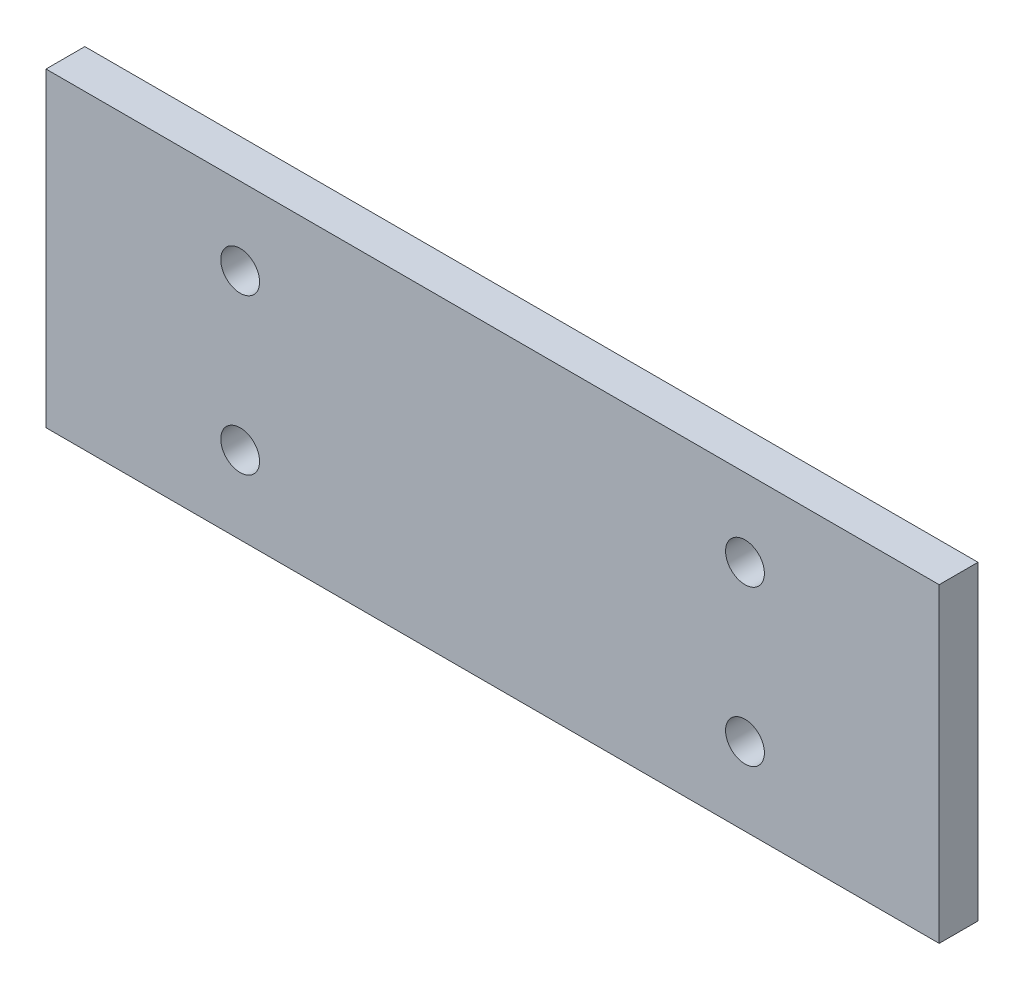
ISO-10303-21;
HEADER;
FILE_DESCRIPTION(('STEP AP214'),'2;1');
FILE_NAME('part.step','',(''),(''),'','','');
FILE_SCHEMA(('AUTOMOTIVE_DESIGN { 1 0 10303 214 1 1 1 1 }'));
ENDSEC;
DATA;
#1=APPLICATION_CONTEXT('core data for automotive mechanical design processes');
#2=APPLICATION_PROTOCOL_DEFINITION('international standard','automotive_design',2000,#1);
#3=PRODUCT_CONTEXT('',#1,'mechanical');
#4=PRODUCT('Part','Part','',(#3));
#5=PRODUCT_RELATED_PRODUCT_CATEGORY('part','',(#4));
#6=PRODUCT_DEFINITION_FORMATION('','',#4);
#7=PRODUCT_DEFINITION_CONTEXT('part definition',#1,'design');
#8=PRODUCT_DEFINITION('design','',#6,#7);
#9=PRODUCT_DEFINITION_SHAPE('','',#8);
#10=(LENGTH_UNIT() NAMED_UNIT(*) SI_UNIT(.MILLI.,.METRE.));
#11=(NAMED_UNIT(*) PLANE_ANGLE_UNIT() SI_UNIT($,.RADIAN.));
#12=(NAMED_UNIT(*) SI_UNIT($,.STERADIAN.) SOLID_ANGLE_UNIT());
#13=UNCERTAINTY_MEASURE_WITH_UNIT(LENGTH_MEASURE(1.E-05),#10,'distance_accuracy_value','');
#14=(GEOMETRIC_REPRESENTATION_CONTEXT(3) GLOBAL_UNCERTAINTY_ASSIGNED_CONTEXT((#13)) GLOBAL_UNIT_ASSIGNED_CONTEXT((#10,
#11,#12)) REPRESENTATION_CONTEXT('',''));
#15=CARTESIAN_POINT('',(0.,0.,0.));
#16=DIRECTION('',(0.,0.,1.));
#17=DIRECTION('',(1.,0.,0.));
#18=AXIS2_PLACEMENT_3D('',#15,#16,#17);
#19=CARTESIAN_POINT('',(0.,0.,5.));
#20=DIRECTION('',(0.,0.,-1.));
#21=DIRECTION('',(-1.,0.,0.));
#22=AXIS2_PLACEMENT_3D('',#19,#20,#21);
#23=PLANE('',#22);
#24=DIRECTION('',(0.,-1.,0.));
#25=VECTOR('',#24,1.);
#26=CARTESIAN_POINT('',(0.,0.,5.));
#27=LINE('',#26,#25);
#28=CARTESIAN_POINT('',(0.,40.,5.));
#29=VERTEX_POINT('',#28);
#30=CARTESIAN_POINT('',(0.,0.,5.));
#31=VERTEX_POINT('',#30);
#32=EDGE_CURVE('E96',#29,#31,#27,.T.);
#33=ORIENTED_EDGE('',*,*,#32,.T.);
#34=DIRECTION('',(1.,0.,0.));
#35=VECTOR('',#34,1.);
#36=CARTESIAN_POINT('',(0.,0.,5.));
#37=LINE('',#36,#35);
#38=CARTESIAN_POINT('',(115.,0.,5.));
#39=VERTEX_POINT('',#38);
#40=EDGE_CURVE('E91',#31,#39,#37,.T.);
#41=ORIENTED_EDGE('',*,*,#40,.T.);
#42=DIRECTION('',(0.,1.,0.));
#43=VECTOR('',#42,1.);
#44=CARTESIAN_POINT('',(115.,0.,5.));
#45=LINE('',#44,#43);
#46=CARTESIAN_POINT('',(115.,40.,5.));
#47=VERTEX_POINT('',#46);
#48=EDGE_CURVE('E94',#39,#47,#45,.T.);
#49=ORIENTED_EDGE('',*,*,#48,.T.);
#50=DIRECTION('',(-1.,0.,0.));
#51=VECTOR('',#50,1.);
#52=CARTESIAN_POINT('',(0.,40.,5.));
#53=LINE('',#52,#51);
#54=EDGE_CURVE('E61',#47,#29,#53,.T.);
#55=ORIENTED_EDGE('',*,*,#54,.T.);
#56=EDGE_LOOP('',(#33,#41,#49,#55));
#57=FACE_BOUND('',#56,.T.);
#58=CARTESIAN_POINT('',(25.,30.,5.));
#59=DIRECTION('',(0.,0.,1.));
#60=DIRECTION('',(1.,0.,0.));
#61=AXIS2_PLACEMENT_3D('',#58,#59,#60);
#62=CIRCLE('',#61,2.5);
#63=CARTESIAN_POINT('',(27.5,30.,5.));
#64=VERTEX_POINT('',#63);
#65=EDGE_CURVE('E118',#64,#64,#62,.T.);
#66=ORIENTED_EDGE('',*,*,#65,.F.);
#67=EDGE_LOOP('',(#66));
#68=FACE_BOUND('',#67,.T.);
#69=CARTESIAN_POINT('',(25.,10.,5.));
#70=DIRECTION('',(0.,0.,1.));
#71=DIRECTION('',(1.,0.,0.));
#72=AXIS2_PLACEMENT_3D('',#69,#70,#71);
#73=CIRCLE('',#72,2.5);
#74=CARTESIAN_POINT('',(27.5,10.,5.));
#75=VERTEX_POINT('',#74);
#76=EDGE_CURVE('E141',#75,#75,#73,.T.);
#77=ORIENTED_EDGE('',*,*,#76,.F.);
#78=EDGE_LOOP('',(#77));
#79=FACE_BOUND('',#78,.T.);
#80=CARTESIAN_POINT('',(90.,10.,5.));
#81=DIRECTION('',(0.,0.,1.));
#82=DIRECTION('',(-1.,0.,0.));
#83=AXIS2_PLACEMENT_3D('',#80,#81,#82);
#84=CIRCLE('',#83,2.5);
#85=CARTESIAN_POINT('',(87.5,10.,5.));
#86=VERTEX_POINT('',#85);
#87=EDGE_CURVE('E149',#86,#86,#84,.T.);
#88=ORIENTED_EDGE('',*,*,#87,.F.);
#89=EDGE_LOOP('',(#88));
#90=FACE_BOUND('',#89,.T.);
#91=CARTESIAN_POINT('',(90.,30.,5.));
#92=DIRECTION('',(0.,0.,1.));
#93=DIRECTION('',(-1.,0.,0.));
#94=AXIS2_PLACEMENT_3D('',#91,#92,#93);
#95=CIRCLE('',#94,2.49999999999999);
#96=CARTESIAN_POINT('',(87.5,30.,5.));
#97=VERTEX_POINT('',#96);
#98=EDGE_CURVE('E156',#97,#97,#95,.T.);
#99=ORIENTED_EDGE('',*,*,#98,.F.);
#100=EDGE_LOOP('',(#99));
#101=FACE_BOUND('',#100,.T.);
#102=ADVANCED_FACE('F43',(#57,#68,#79,#90,#101),#23,.F.);
#103=CARTESIAN_POINT('',(0.,0.,0.));
#104=DIRECTION('',(0.,0.,-1.));
#105=DIRECTION('',(-1.,0.,0.));
#106=AXIS2_PLACEMENT_3D('',#103,#104,#105);
#107=PLANE('',#106);
#108=CARTESIAN_POINT('',(90.,10.,0.));
#109=DIRECTION('',(0.,0.,1.));
#110=DIRECTION('',(-1.,0.,0.));
#111=AXIS2_PLACEMENT_3D('',#108,#109,#110);
#112=CIRCLE('',#111,2.5);
#113=CARTESIAN_POINT('',(87.5,10.,0.));
#114=VERTEX_POINT('',#113);
#115=EDGE_CURVE('E152',#114,#114,#112,.T.);
#116=ORIENTED_EDGE('',*,*,#115,.T.);
#117=EDGE_LOOP('',(#116));
#118=FACE_BOUND('',#117,.T.);
#119=CARTESIAN_POINT('',(25.,30.,0.));
#120=DIRECTION('',(0.,0.,1.));
#121=DIRECTION('',(1.,0.,0.));
#122=AXIS2_PLACEMENT_3D('',#119,#120,#121);
#123=CIRCLE('',#122,2.5);
#124=CARTESIAN_POINT('',(27.5,30.,0.));
#125=VERTEX_POINT('',#124);
#126=EDGE_CURVE('E137',#125,#125,#123,.T.);
#127=ORIENTED_EDGE('',*,*,#126,.T.);
#128=EDGE_LOOP('',(#127));
#129=FACE_BOUND('',#128,.T.);
#130=DIRECTION('',(0.,-1.,0.));
#131=VECTOR('',#130,1.);
#132=CARTESIAN_POINT('',(0.,0.,0.));
#133=LINE('',#132,#131);
#134=CARTESIAN_POINT('',(0.,40.,0.));
#135=VERTEX_POINT('',#134);
#136=CARTESIAN_POINT('',(0.,0.,0.));
#137=VERTEX_POINT('',#136);
#138=EDGE_CURVE('E114',#135,#137,#133,.T.);
#139=ORIENTED_EDGE('',*,*,#138,.F.);
#140=DIRECTION('',(-1.,0.,0.));
#141=VECTOR('',#140,1.);
#142=CARTESIAN_POINT('',(0.,40.,0.));
#143=LINE('',#142,#141);
#144=CARTESIAN_POINT('',(115.,40.,0.));
#145=VERTEX_POINT('',#144);
#146=EDGE_CURVE('E84',#145,#135,#143,.T.);
#147=ORIENTED_EDGE('',*,*,#146,.F.);
#148=DIRECTION('',(0.,1.,0.));
#149=VECTOR('',#148,1.);
#150=CARTESIAN_POINT('',(115.,0.,0.));
#151=LINE('',#150,#149);
#152=CARTESIAN_POINT('',(115.,0.,0.));
#153=VERTEX_POINT('',#152);
#154=EDGE_CURVE('E78',#153,#145,#151,.T.);
#155=ORIENTED_EDGE('',*,*,#154,.F.);
#156=DIRECTION('',(1.,0.,0.));
#157=VECTOR('',#156,1.);
#158=CARTESIAN_POINT('',(0.,0.,0.));
#159=LINE('',#158,#157);
#160=EDGE_CURVE('E101',#137,#153,#159,.T.);
#161=ORIENTED_EDGE('',*,*,#160,.F.);
#162=EDGE_LOOP('',(#139,#147,#155,#161));
#163=FACE_BOUND('',#162,.T.);
#164=CARTESIAN_POINT('',(25.,10.,0.));
#165=DIRECTION('',(0.,0.,1.));
#166=DIRECTION('',(1.,0.,0.));
#167=AXIS2_PLACEMENT_3D('',#164,#165,#166);
#168=CIRCLE('',#167,2.5);
#169=CARTESIAN_POINT('',(27.5,10.,0.));
#170=VERTEX_POINT('',#169);
#171=EDGE_CURVE('E145',#170,#170,#168,.T.);
#172=ORIENTED_EDGE('',*,*,#171,.T.);
#173=EDGE_LOOP('',(#172));
#174=FACE_BOUND('',#173,.T.);
#175=CARTESIAN_POINT('',(90.,30.,0.));
#176=DIRECTION('',(0.,0.,1.));
#177=DIRECTION('',(-1.,0.,0.));
#178=AXIS2_PLACEMENT_3D('',#175,#176,#177);
#179=CIRCLE('',#178,2.49999999999999);
#180=CARTESIAN_POINT('',(87.5,30.,0.));
#181=VERTEX_POINT('',#180);
#182=EDGE_CURVE('E160',#181,#181,#179,.T.);
#183=ORIENTED_EDGE('',*,*,#182,.T.);
#184=EDGE_LOOP('',(#183));
#185=FACE_BOUND('',#184,.T.);
#186=ADVANCED_FACE('F132',(#118,#129,#163,#174,#185),#107,.T.);
#187=CARTESIAN_POINT('',(0.,0.,5.));
#188=DIRECTION('',(1.,0.,0.));
#189=DIRECTION('',(0.,0.,-1.));
#190=AXIS2_PLACEMENT_3D('',#187,#188,#189);
#191=PLANE('',#190);
#192=ORIENTED_EDGE('',*,*,#138,.T.);
#193=DIRECTION('',(0.,0.,-1.));
#194=VECTOR('',#193,1.);
#195=CARTESIAN_POINT('',(0.,0.,5.));
#196=LINE('',#195,#194);
#197=EDGE_CURVE('E11',#31,#137,#196,.T.);
#198=ORIENTED_EDGE('',*,*,#197,.F.);
#199=ORIENTED_EDGE('',*,*,#32,.F.);
#200=DIRECTION('',(0.,0.,-1.));
#201=VECTOR('',#200,1.);
#202=CARTESIAN_POINT('',(0.,40.,5.));
#203=LINE('',#202,#201);
#204=EDGE_CURVE('E110',#29,#135,#203,.T.);
#205=ORIENTED_EDGE('',*,*,#204,.T.);
#206=EDGE_LOOP('',(#192,#198,#199,#205));
#207=FACE_BOUND('',#206,.T.);
#208=ADVANCED_FACE('F45',(#207),#191,.F.);
#209=CARTESIAN_POINT('',(0.,0.,5.));
#210=DIRECTION('',(0.,1.,0.));
#211=DIRECTION('',(0.,0.,1.));
#212=AXIS2_PLACEMENT_3D('',#209,#210,#211);
#213=PLANE('',#212);
#214=ORIENTED_EDGE('',*,*,#160,.T.);
#215=DIRECTION('',(0.,0.,-1.));
#216=VECTOR('',#215,1.);
#217=CARTESIAN_POINT('',(115.,0.,5.));
#218=LINE('',#217,#216);
#219=EDGE_CURVE('E53',#39,#153,#218,.T.);
#220=ORIENTED_EDGE('',*,*,#219,.F.);
#221=ORIENTED_EDGE('',*,*,#40,.F.);
#222=ORIENTED_EDGE('',*,*,#197,.T.);
#223=EDGE_LOOP('',(#214,#220,#221,#222));
#224=FACE_BOUND('',#223,.T.);
#225=ADVANCED_FACE('F100',(#224),#213,.F.);
#226=CARTESIAN_POINT('',(115.,0.,5.));
#227=DIRECTION('',(-1.,0.,0.));
#228=DIRECTION('',(0.,0.,1.));
#229=AXIS2_PLACEMENT_3D('',#226,#227,#228);
#230=PLANE('',#229);
#231=ORIENTED_EDGE('',*,*,#154,.T.);
#232=DIRECTION('',(0.,0.,-1.));
#233=VECTOR('',#232,1.);
#234=CARTESIAN_POINT('',(115.,40.,5.));
#235=LINE('',#234,#233);
#236=EDGE_CURVE('E103',#47,#145,#235,.T.);
#237=ORIENTED_EDGE('',*,*,#236,.F.);
#238=ORIENTED_EDGE('',*,*,#48,.F.);
#239=ORIENTED_EDGE('',*,*,#219,.T.);
#240=EDGE_LOOP('',(#231,#237,#238,#239));
#241=FACE_BOUND('',#240,.T.);
#242=ADVANCED_FACE('F104',(#241),#230,.F.);
#243=CARTESIAN_POINT('',(0.,40.,5.));
#244=DIRECTION('',(0.,-1.,0.));
#245=DIRECTION('',(0.,0.,-1.));
#246=AXIS2_PLACEMENT_3D('',#243,#244,#245);
#247=PLANE('',#246);
#248=ORIENTED_EDGE('',*,*,#146,.T.);
#249=ORIENTED_EDGE('',*,*,#204,.F.);
#250=ORIENTED_EDGE('',*,*,#54,.F.);
#251=ORIENTED_EDGE('',*,*,#236,.T.);
#252=EDGE_LOOP('',(#248,#249,#250,#251));
#253=FACE_BOUND('',#252,.T.);
#254=ADVANCED_FACE('F129',(#253),#247,.F.);
#255=CARTESIAN_POINT('',(25.,30.,5.));
#256=DIRECTION('',(0.,0.,-1.));
#257=DIRECTION('',(-1.,0.,0.));
#258=AXIS2_PLACEMENT_3D('',#255,#256,#257);
#259=CYLINDRICAL_SURFACE('',#258,2.5);
#260=ORIENTED_EDGE('',*,*,#65,.T.);
#261=EDGE_LOOP('',(#260));
#262=FACE_BOUND('',#261,.T.);
#263=ORIENTED_EDGE('',*,*,#126,.F.);
#264=EDGE_LOOP('',(#263));
#265=FACE_BOUND('',#264,.T.);
#266=ADVANCED_FACE('F176',(#262,#265),#259,.F.);
#267=CARTESIAN_POINT('',(25.,10.,5.));
#268=DIRECTION('',(0.,0.,-1.));
#269=DIRECTION('',(-1.,0.,0.));
#270=AXIS2_PLACEMENT_3D('',#267,#268,#269);
#271=CYLINDRICAL_SURFACE('',#270,2.5);
#272=ORIENTED_EDGE('',*,*,#76,.T.);
#273=EDGE_LOOP('',(#272));
#274=FACE_BOUND('',#273,.T.);
#275=ORIENTED_EDGE('',*,*,#171,.F.);
#276=EDGE_LOOP('',(#275));
#277=FACE_BOUND('',#276,.T.);
#278=ADVANCED_FACE('F227',(#274,#277),#271,.F.);
#279=CARTESIAN_POINT('',(90.,10.,5.));
#280=DIRECTION('',(0.,0.,-1.));
#281=DIRECTION('',(-1.,0.,0.));
#282=AXIS2_PLACEMENT_3D('',#279,#280,#281);
#283=CYLINDRICAL_SURFACE('',#282,2.5);
#284=ORIENTED_EDGE('',*,*,#87,.T.);
#285=EDGE_LOOP('',(#284));
#286=FACE_BOUND('',#285,.T.);
#287=ORIENTED_EDGE('',*,*,#115,.F.);
#288=EDGE_LOOP('',(#287));
#289=FACE_BOUND('',#288,.T.);
#290=ADVANCED_FACE('F236',(#286,#289),#283,.F.);
#291=CARTESIAN_POINT('',(90.,30.,5.));
#292=DIRECTION('',(0.,0.,-1.));
#293=DIRECTION('',(-1.,0.,0.));
#294=AXIS2_PLACEMENT_3D('',#291,#292,#293);
#295=CYLINDRICAL_SURFACE('',#294,2.49999999999999);
#296=ORIENTED_EDGE('',*,*,#98,.T.);
#297=EDGE_LOOP('',(#296));
#298=FACE_BOUND('',#297,.T.);
#299=ORIENTED_EDGE('',*,*,#182,.F.);
#300=EDGE_LOOP('',(#299));
#301=FACE_BOUND('',#300,.T.);
#302=ADVANCED_FACE('F166',(#298,#301),#295,.F.);
#303=CLOSED_SHELL('',(#102,#186,#208,#225,#242,#254,#266,#278,#290,#302));
#304=MANIFOLD_SOLID_BREP('B2',#303);
#305=ADVANCED_BREP_SHAPE_REPRESENTATION('',(#18,#304),#14);
#306=SHAPE_DEFINITION_REPRESENTATION(#9,#305);
ENDSEC;
END-ISO-10303-21;
